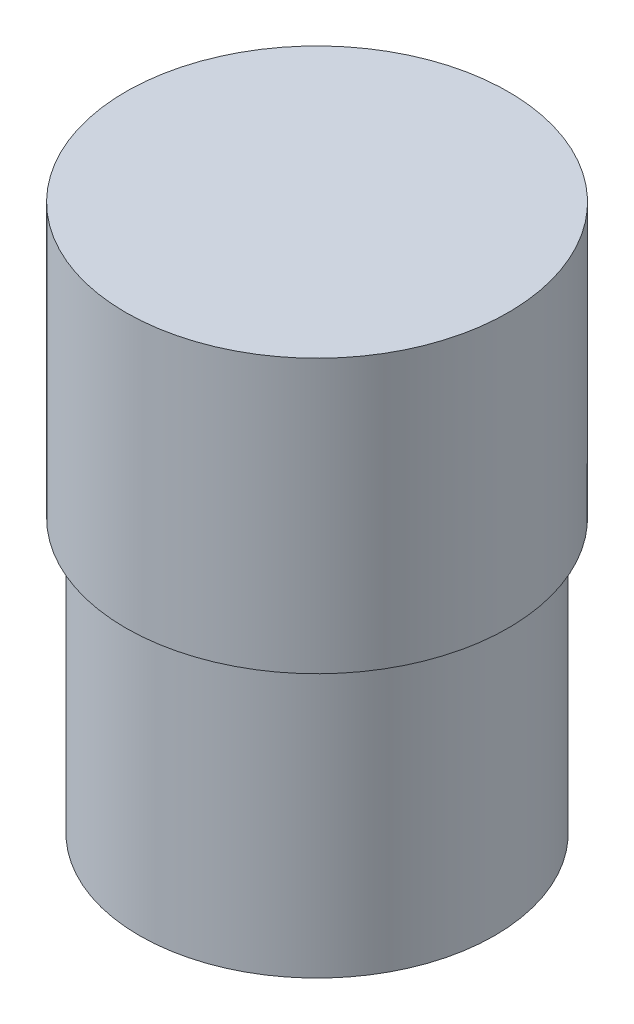
ISO-10303-21;
HEADER;
FILE_DESCRIPTION(('STEP AP214'),'2;1');
FILE_NAME('part.step','',(''),(''),'','','');
FILE_SCHEMA(('AUTOMOTIVE_DESIGN { 1 0 10303 214 1 1 1 1 }'));
ENDSEC;
DATA;
#1=APPLICATION_CONTEXT('core data for automotive mechanical design processes');
#2=APPLICATION_PROTOCOL_DEFINITION('international standard','automotive_design',2000,#1);
#3=PRODUCT_CONTEXT('',#1,'mechanical');
#4=PRODUCT('Part','Part','',(#3));
#5=PRODUCT_RELATED_PRODUCT_CATEGORY('part','',(#4));
#6=PRODUCT_DEFINITION_FORMATION('','',#4);
#7=PRODUCT_DEFINITION_CONTEXT('part definition',#1,'design');
#8=PRODUCT_DEFINITION('design','',#6,#7);
#9=PRODUCT_DEFINITION_SHAPE('','',#8);
#10=(LENGTH_UNIT() NAMED_UNIT(*) SI_UNIT(.MILLI.,.METRE.));
#11=(NAMED_UNIT(*) PLANE_ANGLE_UNIT() SI_UNIT($,.RADIAN.));
#12=(NAMED_UNIT(*) SI_UNIT($,.STERADIAN.) SOLID_ANGLE_UNIT());
#13=UNCERTAINTY_MEASURE_WITH_UNIT(LENGTH_MEASURE(1.E-05),#10,'distance_accuracy_value','');
#14=(GEOMETRIC_REPRESENTATION_CONTEXT(3) GLOBAL_UNCERTAINTY_ASSIGNED_CONTEXT((#13)) GLOBAL_UNIT_ASSIGNED_CONTEXT((#10,
#11,#12)) REPRESENTATION_CONTEXT('',''));
#15=CARTESIAN_POINT('',(0.,0.,0.));
#16=DIRECTION('',(0.,0.,1.));
#17=DIRECTION('',(1.,0.,0.));
#18=AXIS2_PLACEMENT_3D('',#15,#16,#17);
#19=CARTESIAN_POINT('',(0.,63.5,0.));
#20=DIRECTION('',(0.,-1.,0.));
#21=DIRECTION('',(0.,0.,-1.));
#22=AXIS2_PLACEMENT_3D('',#19,#20,#21);
#23=CYLINDRICAL_SURFACE('',#22,41.275);
#24=CARTESIAN_POINT('',(0.,63.5,0.));
#25=DIRECTION('',(0.,1.,0.));
#26=DIRECTION('',(0.,0.,1.));
#27=AXIS2_PLACEMENT_3D('',#24,#25,#26);
#28=CIRCLE('',#27,41.275);
#29=CARTESIAN_POINT('',(0.,63.5,41.275));
#30=VERTEX_POINT('',#29);
#31=EDGE_CURVE('E10',#30,#30,#28,.T.);
#32=ORIENTED_EDGE('',*,*,#31,.F.);
#33=EDGE_LOOP('',(#32));
#34=FACE_BOUND('',#33,.T.);
#35=CARTESIAN_POINT('',(0.,0.,0.));
#36=DIRECTION('',(0.,1.,0.));
#37=DIRECTION('',(0.,0.,1.));
#38=AXIS2_PLACEMENT_3D('',#35,#36,#37);
#39=CIRCLE('',#38,41.275);
#40=CARTESIAN_POINT('',(0.,0.,41.275));
#41=VERTEX_POINT('',#40);
#42=EDGE_CURVE('E40',#41,#41,#39,.T.);
#43=ORIENTED_EDGE('',*,*,#42,.T.);
#44=EDGE_LOOP('',(#43));
#45=FACE_BOUND('',#44,.T.);
#46=ADVANCED_FACE('F37',(#34,#45),#23,.T.);
#47=CARTESIAN_POINT('',(0.,0.,0.));
#48=DIRECTION('',(0.,1.,0.));
#49=DIRECTION('',(0.,0.,1.));
#50=AXIS2_PLACEMENT_3D('',#47,#48,#49);
#51=PLANE('',#50);
#52=ORIENTED_EDGE('',*,*,#42,.F.);
#53=EDGE_LOOP('',(#52));
#54=FACE_BOUND('',#53,.T.);
#55=ADVANCED_FACE('F60',(#54),#51,.F.);
#56=CARTESIAN_POINT('',(0.,127.,0.));
#57=DIRECTION('',(0.,-1.,0.));
#58=DIRECTION('',(0.,0.,-1.));
#59=AXIS2_PLACEMENT_3D('',#56,#57,#58);
#60=CYLINDRICAL_SURFACE('',#59,44.45);
#61=CARTESIAN_POINT('',(0.,127.,0.));
#62=DIRECTION('',(0.,1.,0.));
#63=DIRECTION('',(0.,0.,1.));
#64=AXIS2_PLACEMENT_3D('',#61,#62,#63);
#65=CIRCLE('',#64,44.45);
#66=CARTESIAN_POINT('',(0.,127.,44.45));
#67=VERTEX_POINT('',#66);
#68=EDGE_CURVE('E47',#67,#67,#65,.T.);
#69=ORIENTED_EDGE('',*,*,#68,.F.);
#70=EDGE_LOOP('',(#69));
#71=FACE_BOUND('',#70,.T.);
#72=CARTESIAN_POINT('',(0.,63.5,0.));
#73=DIRECTION('',(0.,1.,0.));
#74=DIRECTION('',(0.,0.,1.));
#75=AXIS2_PLACEMENT_3D('',#72,#73,#74);
#76=CIRCLE('',#75,44.45);
#77=CARTESIAN_POINT('',(0.,63.5,44.45));
#78=VERTEX_POINT('',#77);
#79=EDGE_CURVE('E49',#78,#78,#76,.T.);
#80=ORIENTED_EDGE('',*,*,#79,.T.);
#81=EDGE_LOOP('',(#80));
#82=FACE_BOUND('',#81,.T.);
#83=ADVANCED_FACE('F57',(#71,#82),#60,.T.);
#84=CARTESIAN_POINT('',(0.,127.,0.));
#85=DIRECTION('',(0.,1.,0.));
#86=DIRECTION('',(0.,0.,1.));
#87=AXIS2_PLACEMENT_3D('',#84,#85,#86);
#88=PLANE('',#87);
#89=ORIENTED_EDGE('',*,*,#68,.T.);
#90=EDGE_LOOP('',(#89));
#91=FACE_BOUND('',#90,.T.);
#92=ADVANCED_FACE('F55',(#91),#88,.T.);
#93=CARTESIAN_POINT('',(0.,63.5,0.));
#94=DIRECTION('',(0.,1.,0.));
#95=DIRECTION('',(0.,0.,1.));
#96=AXIS2_PLACEMENT_3D('',#93,#94,#95);
#97=PLANE('',#96);
#98=ORIENTED_EDGE('',*,*,#31,.T.);
#99=EDGE_LOOP('',(#98));
#100=FACE_BOUND('',#99,.T.);
#101=ORIENTED_EDGE('',*,*,#79,.F.);
#102=EDGE_LOOP('',(#101));
#103=FACE_BOUND('',#102,.T.);
#104=ADVANCED_FACE('F64',(#100,#103),#97,.F.);
#105=CLOSED_SHELL('',(#46,#55,#83,#92,#104));
#106=MANIFOLD_SOLID_BREP('B2',#105);
#107=ADVANCED_BREP_SHAPE_REPRESENTATION('',(#18,#106),#14);
#108=SHAPE_DEFINITION_REPRESENTATION(#9,#107);
ENDSEC;
END-ISO-10303-21;
